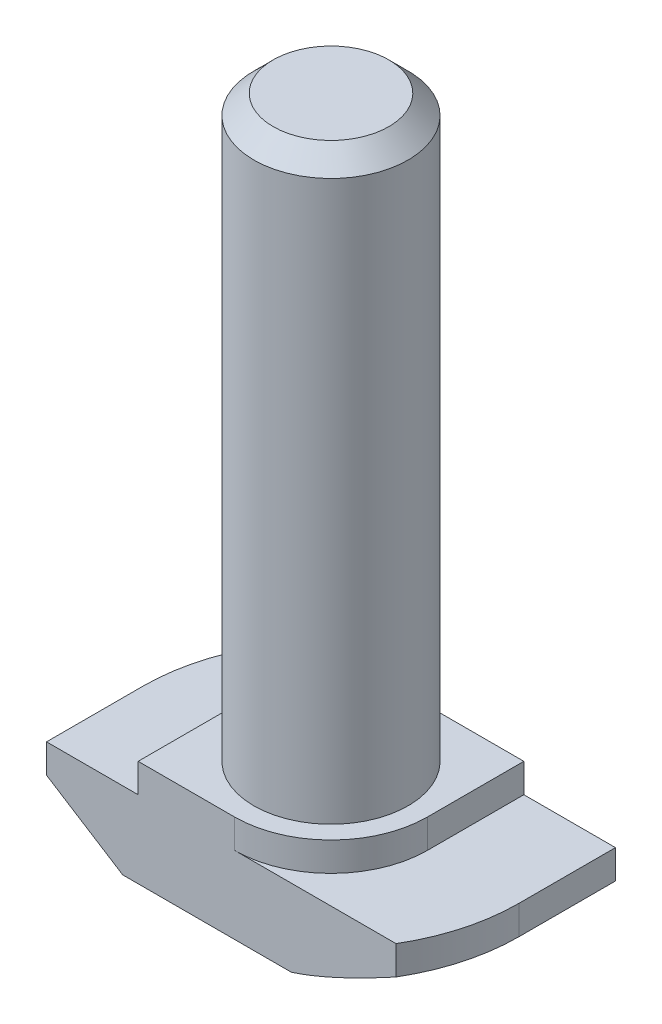
ISO-10303-21;
HEADER;
FILE_DESCRIPTION(('STEP AP214'),'2;1');
FILE_NAME('part.step','',(''),(''),'','','');
FILE_SCHEMA(('AUTOMOTIVE_DESIGN { 1 0 10303 214 1 1 1 1 }'));
ENDSEC;
DATA;
#1=APPLICATION_CONTEXT('core data for automotive mechanical design processes');
#2=APPLICATION_PROTOCOL_DEFINITION('international standard','automotive_design',2000,#1);
#3=PRODUCT_CONTEXT('',#1,'mechanical');
#4=PRODUCT('Part','Part','',(#3));
#5=PRODUCT_RELATED_PRODUCT_CATEGORY('part','',(#4));
#6=PRODUCT_DEFINITION_FORMATION('','',#4);
#7=PRODUCT_DEFINITION_CONTEXT('part definition',#1,'design');
#8=PRODUCT_DEFINITION('design','',#6,#7);
#9=PRODUCT_DEFINITION_SHAPE('','',#8);
#10=(LENGTH_UNIT() NAMED_UNIT(*) SI_UNIT(.MILLI.,.METRE.));
#11=(NAMED_UNIT(*) PLANE_ANGLE_UNIT() SI_UNIT($,.RADIAN.));
#12=(NAMED_UNIT(*) SI_UNIT($,.STERADIAN.) SOLID_ANGLE_UNIT());
#13=UNCERTAINTY_MEASURE_WITH_UNIT(LENGTH_MEASURE(1.E-05),#10,'distance_accuracy_value','');
#14=(GEOMETRIC_REPRESENTATION_CONTEXT(3) GLOBAL_UNCERTAINTY_ASSIGNED_CONTEXT((#13)) GLOBAL_UNIT_ASSIGNED_CONTEXT((#10,
#11,#12)) REPRESENTATION_CONTEXT('',''));
#15=CARTESIAN_POINT('',(0.,0.,0.));
#16=DIRECTION('',(0.,0.,1.));
#17=DIRECTION('',(1.,0.,0.));
#18=AXIS2_PLACEMENT_3D('',#15,#16,#17);
#19=CARTESIAN_POINT('',(-9.75,0.,5.));
#20=DIRECTION('',(1.,0.,0.));
#21=DIRECTION('',(0.,0.,-1.));
#22=AXIS2_PLACEMENT_3D('',#19,#20,#21);
#23=PLANE('',#22);
#24=DIRECTION('',(0.,0.,-1.));
#25=VECTOR('',#24,1.);
#26=CARTESIAN_POINT('',(-9.75,2.5,5.));
#27=LINE('',#26,#25);
#28=CARTESIAN_POINT('',(-9.75,2.5,5.));
#29=VERTEX_POINT('',#28);
#30=CARTESIAN_POINT('',(-9.75,2.5,0.));
#31=VERTEX_POINT('',#30);
#32=EDGE_CURVE('E372',#29,#31,#27,.T.);
#33=ORIENTED_EDGE('',*,*,#32,.F.);
#34=DIRECTION('',(0.,-1.,0.));
#35=VECTOR('',#34,1.);
#36=CARTESIAN_POINT('',(-9.75,0.,5.));
#37=LINE('',#36,#35);
#38=CARTESIAN_POINT('',(-9.75,4.,5.));
#39=VERTEX_POINT('',#38);
#40=EDGE_CURVE('E209',#39,#29,#37,.T.);
#41=ORIENTED_EDGE('',*,*,#40,.F.);
#42=DIRECTION('',(0.,0.,-1.));
#43=VECTOR('',#42,1.);
#44=CARTESIAN_POINT('',(-9.75,4.,5.));
#45=LINE('',#44,#43);
#46=CARTESIAN_POINT('',(-9.75,4.,0.));
#47=VERTEX_POINT('',#46);
#48=EDGE_CURVE('E224',#39,#47,#45,.T.);
#49=ORIENTED_EDGE('',*,*,#48,.T.);
#50=DIRECTION('',(0.,1.,0.));
#51=VECTOR('',#50,1.);
#52=CARTESIAN_POINT('',(-9.75,0.,0.));
#53=LINE('',#52,#51);
#54=EDGE_CURVE('E190',#31,#47,#53,.T.);
#55=ORIENTED_EDGE('',*,*,#54,.F.);
#56=EDGE_LOOP('',(#33,#41,#49,#55));
#57=FACE_BOUND('',#56,.T.);
#58=ADVANCED_FACE('F37',(#57),#23,.F.);
#59=CARTESIAN_POINT('',(9.75,0.,5.));
#60=DIRECTION('',(0.,1.,0.));
#61=DIRECTION('',(0.,0.,1.));
#62=AXIS2_PLACEMENT_3D('',#59,#60,#61);
#63=PLANE('',#62);
#64=DIRECTION('',(1.,0.,0.));
#65=VECTOR('',#64,1.);
#66=CARTESIAN_POINT('',(9.75,0.,5.));
#67=LINE('',#66,#65);
#68=CARTESIAN_POINT('',(-5.8,0.,5.));
#69=VERTEX_POINT('',#68);
#70=CARTESIAN_POINT('',(2.93938769133981,0.,5.));
#71=VERTEX_POINT('',#70);
#72=EDGE_CURVE('E212',#69,#71,#67,.T.);
#73=ORIENTED_EDGE('',*,*,#72,.F.);
#74=DIRECTION('',(0.,0.,-1.));
#75=VECTOR('',#74,1.);
#76=CARTESIAN_POINT('',(-5.8,0.,5.));
#77=LINE('',#76,#75);
#78=CARTESIAN_POINT('',(-5.8,0.,0.));
#79=VERTEX_POINT('',#78);
#80=EDGE_CURVE('E375',#69,#79,#77,.T.);
#81=ORIENTED_EDGE('',*,*,#80,.T.);
#82=CARTESIAN_POINT('',(0.,0.,0.));
#83=DIRECTION('',(0.,-1.,0.));
#84=DIRECTION('',(-1.,0.,0.));
#85=AXIS2_PLACEMENT_3D('',#82,#83,#84);
#86=CIRCLE('',#85,5.8);
#87=CARTESIAN_POINT('',(-2.93938769133982,0.,-5.));
#88=VERTEX_POINT('',#87);
#89=EDGE_CURVE('E385',#79,#88,#86,.T.);
#90=ORIENTED_EDGE('',*,*,#89,.T.);
#91=DIRECTION('',(1.,0.,0.));
#92=VECTOR('',#91,1.);
#93=CARTESIAN_POINT('',(9.75,0.,-5.));
#94=LINE('',#93,#92);
#95=CARTESIAN_POINT('',(5.8,0.,-5.));
#96=VERTEX_POINT('',#95);
#97=EDGE_CURVE('E208',#88,#96,#94,.T.);
#98=ORIENTED_EDGE('',*,*,#97,.T.);
#99=DIRECTION('',(0.,0.,1.));
#100=VECTOR('',#99,1.);
#101=CARTESIAN_POINT('',(5.8,0.,-9.75));
#102=LINE('',#101,#100);
#103=CARTESIAN_POINT('',(5.8,0.,0.));
#104=VERTEX_POINT('',#103);
#105=EDGE_CURVE('E53',#96,#104,#102,.T.);
#106=ORIENTED_EDGE('',*,*,#105,.T.);
#107=CARTESIAN_POINT('',(0.,0.,0.));
#108=DIRECTION('',(0.,-1.,0.));
#109=DIRECTION('',(1.,0.,0.));
#110=AXIS2_PLACEMENT_3D('',#107,#108,#109);
#111=CIRCLE('',#110,5.8);
#112=EDGE_CURVE('E153',#104,#71,#111,.T.);
#113=ORIENTED_EDGE('',*,*,#112,.T.);
#114=EDGE_LOOP('',(#73,#81,#90,#98,#106,#113));
#115=FACE_BOUND('',#114,.T.);
#116=ADVANCED_FACE('F270',(#115),#63,.F.);
#117=CARTESIAN_POINT('',(9.75,0.,5.));
#118=DIRECTION('',(-1.,0.,0.));
#119=DIRECTION('',(0.,0.,1.));
#120=AXIS2_PLACEMENT_3D('',#117,#118,#119);
#121=PLANE('',#120);
#122=DIRECTION('',(0.,0.,1.));
#123=VECTOR('',#122,1.);
#124=CARTESIAN_POINT('',(9.75,2.5,-9.75));
#125=LINE('',#124,#123);
#126=CARTESIAN_POINT('',(9.75,2.5,-5.));
#127=VERTEX_POINT('',#126);
#128=CARTESIAN_POINT('',(9.75,2.5,0.));
#129=VERTEX_POINT('',#128);
#130=EDGE_CURVE('E145',#127,#129,#125,.T.);
#131=ORIENTED_EDGE('',*,*,#130,.F.);
#132=DIRECTION('',(0.,1.,0.));
#133=VECTOR('',#132,1.);
#134=CARTESIAN_POINT('',(9.75,0.,-5.));
#135=LINE('',#134,#133);
#136=CARTESIAN_POINT('',(9.75,4.,-5.));
#137=VERTEX_POINT('',#136);
#138=EDGE_CURVE('E227',#127,#137,#135,.T.);
#139=ORIENTED_EDGE('',*,*,#138,.T.);
#140=DIRECTION('',(0.,0.,-1.));
#141=VECTOR('',#140,1.);
#142=CARTESIAN_POINT('',(9.75,4.,5.));
#143=LINE('',#142,#141);
#144=CARTESIAN_POINT('',(9.75,4.,0.));
#145=VERTEX_POINT('',#144);
#146=EDGE_CURVE('E173',#145,#137,#143,.T.);
#147=ORIENTED_EDGE('',*,*,#146,.F.);
#148=DIRECTION('',(0.,1.,0.));
#149=VECTOR('',#148,1.);
#150=CARTESIAN_POINT('',(9.75,0.,0.));
#151=LINE('',#150,#149);
#152=EDGE_CURVE('E166',#129,#145,#151,.T.);
#153=ORIENTED_EDGE('',*,*,#152,.F.);
#154=EDGE_LOOP('',(#131,#139,#147,#153));
#155=FACE_BOUND('',#154,.T.);
#156=ADVANCED_FACE('F171',(#155),#121,.F.);
#157=CARTESIAN_POINT('',(0.,0.,5.));
#158=DIRECTION('',(0.,0.,-1.));
#159=DIRECTION('',(-1.,0.,0.));
#160=AXIS2_PLACEMENT_3D('',#157,#158,#159);
#161=PLANE('',#160);
#162=DIRECTION('',(-0.844980197489509,0.534797593347791,0.));
#163=VECTOR('',#162,1.);
#164=CARTESIAN_POINT('',(-9.75,2.5,5.));
#165=LINE('',#164,#163);
#166=EDGE_CURVE('E373',#69,#29,#165,.T.);
#167=ORIENTED_EDGE('',*,*,#166,.F.);
#168=ORIENTED_EDGE('',*,*,#72,.T.);
#169=CARTESIAN_POINT('',(8.3710345213916,2.50038035044416,5.));
#170=CARTESIAN_POINT('',(8.14485503763147,2.37751255056509,5.));
#171=CARTESIAN_POINT('',(7.91814414436424,2.25560825185528,5.));
#172=CARTESIAN_POINT('',(7.46336802856226,2.01427419874183,5.));
#173=CARTESIAN_POINT('',(7.23530261352057,1.89484480745523,5.));
#174=CARTESIAN_POINT('',(6.77658273225198,1.65852444966252,5.));
#175=CARTESIAN_POINT('',(6.54592128446781,1.54164699581211,5.));
#176=CARTESIAN_POINT('',(6.08267383878011,1.31178770374963,5.));
#177=CARTESIAN_POINT('',(5.85008793878494,1.19880566884712,5.));
#178=CARTESIAN_POINT('',(5.38850045895099,0.980602867779513,5.));
#179=CARTESIAN_POINT('',(5.1595578408824,0.875257869563463,5.));
#180=CARTESIAN_POINT('',(4.69895239023341,0.670592548807996,5.));
#181=CARTESIAN_POINT('',(4.46728928872485,0.571272827972461,5.));
#182=CARTESIAN_POINT('',(4.00108707979834,0.38059166900738,5.));
#183=CARTESIAN_POINT('',(3.76655273287754,0.289218677543095,5.));
#184=CARTESIAN_POINT('',(3.29379614776259,0.116644148005836,5.));
#185=CARTESIAN_POINT('',(3.05557490729072,0.0354399103972046,5.));
#186=CARTESIAN_POINT('',(2.58854667138869,-0.109582099168053,5.));
#187=CARTESIAN_POINT('',(2.35996631966938,-0.174122082532671,5.));
#188=CARTESIAN_POINT('',(1.89919260818542,-0.288382603381046,5.));
#189=CARTESIAN_POINT('',(1.66700173473846,-0.33811290172539,5.));
#190=CARTESIAN_POINT('',(1.31509928874305,-0.399489564391158,5.));
#191=CARTESIAN_POINT('',(1.19653459621012,-0.417808799856712,5.));
#192=CARTESIAN_POINT('',(0.958746309721246,-0.449516897628666,5.));
#193=CARTESIAN_POINT('',(0.839522754036867,-0.462906043317658,5.));
#194=CARTESIAN_POINT('',(0.600273143638718,-0.484487035929079,5.));
#195=CARTESIAN_POINT('',(0.480245784105953,-0.492664504258673,5.));
#196=CARTESIAN_POINT('',(0.239914647066935,-0.50360257514633,5.));
#197=CARTESIAN_POINT('',(0.119610806307569,-0.506361781459069,5.));
#198=CARTESIAN_POINT('',(-0.000700000000000271,-0.506329082911393,5.));
#199=B_SPLINE_CURVE_WITH_KNOTS('',3,(#169,#170,#171,#172,#173,#174,#175,#176,#177,#178,#179,
#180,#181,#182,#183,#184,#185,#186,#187,#188,#189,#190,#191,#192,#193,#194,#195,#196,#197,#198),
.UNSPECIFIED.,.F.,.F.,(4,2,2,2,2,2,2,2,2,2,2,2,2,2,4),(0.,0.772201750738158,1.54451600760777,
2.32023520866627,3.09591518399236,3.85189775311528,4.60795569327251,5.36289539506572,
6.1176342534965,6.82981297940338,7.54152127390794,7.90134934767844,8.26115673522602,
8.62195255315834,8.98284133326183),.UNSPECIFIED.);
#200=CARTESIAN_POINT('',(8.3703345213916,2.5,5.));
#201=VERTEX_POINT('',#200);
#202=EDGE_CURVE('E318',#201,#71,#199,.T.);
#203=ORIENTED_EDGE('',*,*,#202,.F.);
#204=DIRECTION('',(0.,1.,0.));
#205=VECTOR('',#204,1.);
#206=CARTESIAN_POINT('',(8.3703345213916,0.,5.));
#207=LINE('',#206,#205);
#208=CARTESIAN_POINT('',(8.3703345213916,4.,5.));
#209=VERTEX_POINT('',#208);
#210=EDGE_CURVE('E168',#201,#209,#207,.T.);
#211=ORIENTED_EDGE('',*,*,#210,.T.);
#212=DIRECTION('',(-1.,0.,0.));
#213=VECTOR('',#212,1.);
#214=CARTESIAN_POINT('',(9.75,4.,5.));
#215=LINE('',#214,#213);
#216=CARTESIAN_POINT('',(0.,4.,5.));
#217=VERTEX_POINT('',#216);
#218=EDGE_CURVE('E216',#209,#217,#215,.T.);
#219=ORIENTED_EDGE('',*,*,#218,.T.);
#220=DIRECTION('',(0.,1.,0.));
#221=VECTOR('',#220,1.);
#222=CARTESIAN_POINT('',(0.,-3.07106781186548,5.));
#223=LINE('',#222,#221);
#224=CARTESIAN_POINT('',(0.,5.5,5.));
#225=VERTEX_POINT('',#224);
#226=EDGE_CURVE('E194',#217,#225,#223,.T.);
#227=ORIENTED_EDGE('',*,*,#226,.T.);
#228=DIRECTION('',(-1.,0.,0.));
#229=VECTOR('',#228,1.);
#230=CARTESIAN_POINT('',(-5.,5.5,5.));
#231=LINE('',#230,#229);
#232=CARTESIAN_POINT('',(-5.,5.5,5.));
#233=VERTEX_POINT('',#232);
#234=EDGE_CURVE('E218',#225,#233,#231,.T.);
#235=ORIENTED_EDGE('',*,*,#234,.T.);
#236=DIRECTION('',(0.,-1.,0.));
#237=VECTOR('',#236,1.);
#238=CARTESIAN_POINT('',(-5.,4.,5.));
#239=LINE('',#238,#237);
#240=CARTESIAN_POINT('',(-5.,4.,5.));
#241=VERTEX_POINT('',#240);
#242=EDGE_CURVE('E220',#233,#241,#239,.T.);
#243=ORIENTED_EDGE('',*,*,#242,.T.);
#244=DIRECTION('',(-1.,0.,0.));
#245=VECTOR('',#244,1.);
#246=CARTESIAN_POINT('',(-9.75,4.,5.));
#247=LINE('',#246,#245);
#248=EDGE_CURVE('E222',#241,#39,#247,.T.);
#249=ORIENTED_EDGE('',*,*,#248,.T.);
#250=ORIENTED_EDGE('',*,*,#40,.T.);
#251=EDGE_LOOP('',(#167,#168,#203,#211,#219,#227,#235,#243,#249,#250));
#252=FACE_BOUND('',#251,.T.);
#253=ADVANCED_FACE('F281',(#252),#161,.F.);
#254=CARTESIAN_POINT('',(0.,0.,-5.));
#255=DIRECTION('',(0.,0.,-1.));
#256=DIRECTION('',(-1.,0.,0.));
#257=AXIS2_PLACEMENT_3D('',#254,#255,#256);
#258=PLANE('',#257);
#259=ORIENTED_EDGE('',*,*,#97,.F.);
#260=CARTESIAN_POINT('',(0.00070000000000138,-0.506329082911397,-5.));
#261=CARTESIAN_POINT('',(-0.11492355286762,-0.506358201187866,-5.));
#262=CARTESIAN_POINT('',(-0.230541342283267,-0.503811651701555,-5.));
#263=CARTESIAN_POINT('',(-0.461532910337905,-0.493707507103407,-5.));
#264=CARTESIAN_POINT('',(-0.576906737550149,-0.48615102719651,-5.));
#265=CARTESIAN_POINT('',(-0.806948113963408,-0.466191618236643,-5.));
#266=CARTESIAN_POINT('',(-0.921616700128454,-0.453800577810883,-5.));
#267=CARTESIAN_POINT('',(-1.15036260798101,-0.424427750820964,-5.));
#268=CARTESIAN_POINT('',(-1.26443990025042,-0.407445738038838,-5.));
#269=CARTESIAN_POINT('',(-1.60314096911344,-0.350479262852961,-5.));
#270=CARTESIAN_POINT('',(-1.82673025128966,-0.304244681434307,-5.));
#271=CARTESIAN_POINT('',(-2.27058382288403,-0.197749704270996,-5.));
#272=CARTESIAN_POINT('',(-2.49084621805169,-0.13748161665558,-5.));
#273=CARTESIAN_POINT('',(-2.95448552535975,0.00231900980771354,-5.));
#274=CARTESIAN_POINT('',(-3.19742086780124,0.0833022458753652,-5.));
#275=CARTESIAN_POINT('',(-3.67941522891594,0.256156738222036,-5.));
#276=CARTESIAN_POINT('',(-3.91847303773159,0.348031321223873,-5.));
#277=CARTESIAN_POINT('',(-4.39361886594961,0.540256398970149,-5.));
#278=CARTESIAN_POINT('',(-4.62970092868475,0.640621503905241,-5.));
#279=CARTESIAN_POINT('',(-5.09899519125866,0.847741673465407,-5.));
#280=CARTESIAN_POINT('',(-5.33220771380245,0.95449601149878,-5.));
#281=CARTESIAN_POINT('',(-5.80260552399803,1.17594489337857,-5.));
#282=CARTESIAN_POINT('',(-6.0397260114898,1.29077650765228,-5.));
#283=CARTESIAN_POINT('',(-6.51194869465368,1.52453629386533,-5.));
#284=CARTESIAN_POINT('',(-6.74705077660686,1.6434646947539,-5.));
#285=CARTESIAN_POINT('',(-7.21442387447975,1.88395034865552,-5.));
#286=CARTESIAN_POINT('',(-7.44670315486301,2.00549158860828,-5.));
#287=CARTESIAN_POINT('',(-7.90984974140112,2.25114994882745,-5.));
#288=CARTESIAN_POINT('',(-8.14071726576929,2.37526665727356,-5.));
#289=CARTESIAN_POINT('',(-8.3710345213916,2.50038035044416,-5.));
#290=B_SPLINE_CURVE_WITH_KNOTS('',3,(#260,#261,#262,#263,#264,#265,#266,#267,#268,#269,#270,
#271,#272,#273,#274,#275,#276,#277,#278,#279,#280,#281,#282,#283,#284,#285,#286,#287,#288,#289),
.UNSPECIFIED.,.F.,.F.,(4,2,2,2,2,2,2,2,2,2,2,2,2,2,4),(0.,0.346832601073218,0.693588023504655,
1.03949606304986,1.38542115015583,2.06977108877902,2.75449701140492,3.52238142993095,
4.29050100328089,5.05997031676438,5.82935229087948,6.61968962937037,7.41007120780528,
8.19652251048066,8.98284901326047),.UNSPECIFIED.);
#291=CARTESIAN_POINT('',(-8.3703345213916,2.5,-5.));
#292=VERTEX_POINT('',#291);
#293=EDGE_CURVE('E312',#88,#292,#290,.T.);
#294=ORIENTED_EDGE('',*,*,#293,.T.);
#295=DIRECTION('',(0.,1.,0.));
#296=VECTOR('',#295,1.);
#297=CARTESIAN_POINT('',(-8.3703345213916,0.,-5.));
#298=LINE('',#297,#296);
#299=CARTESIAN_POINT('',(-8.3703345213916,4.,-5.));
#300=VERTEX_POINT('',#299);
#301=EDGE_CURVE('E177',#292,#300,#298,.T.);
#302=ORIENTED_EDGE('',*,*,#301,.T.);
#303=DIRECTION('',(-1.,0.,0.));
#304=VECTOR('',#303,1.);
#305=CARTESIAN_POINT('',(-9.75,4.,-5.));
#306=LINE('',#305,#304);
#307=CARTESIAN_POINT('',(0.,4.,-5.));
#308=VERTEX_POINT('',#307);
#309=EDGE_CURVE('E213',#308,#300,#306,.T.);
#310=ORIENTED_EDGE('',*,*,#309,.F.);
#311=DIRECTION('',(0.,1.,0.));
#312=VECTOR('',#311,1.);
#313=CARTESIAN_POINT('',(0.,-3.07106781186548,-5.));
#314=LINE('',#313,#312);
#315=CARTESIAN_POINT('',(0.,5.5,-5.));
#316=VERTEX_POINT('',#315);
#317=EDGE_CURVE('E204',#308,#316,#314,.T.);
#318=ORIENTED_EDGE('',*,*,#317,.T.);
#319=DIRECTION('',(-1.,0.,0.));
#320=VECTOR('',#319,1.);
#321=CARTESIAN_POINT('',(-5.,5.5,-5.));
#322=LINE('',#321,#320);
#323=CARTESIAN_POINT('',(5.,5.5,-5.));
#324=VERTEX_POINT('',#323);
#325=EDGE_CURVE('E235',#324,#316,#322,.T.);
#326=ORIENTED_EDGE('',*,*,#325,.F.);
#327=DIRECTION('',(0.,1.,0.));
#328=VECTOR('',#327,1.);
#329=CARTESIAN_POINT('',(5.,4.,-5.));
#330=LINE('',#329,#328);
#331=CARTESIAN_POINT('',(5.,4.,-5.));
#332=VERTEX_POINT('',#331);
#333=EDGE_CURVE('E232',#332,#324,#330,.T.);
#334=ORIENTED_EDGE('',*,*,#333,.F.);
#335=DIRECTION('',(-1.,0.,0.));
#336=VECTOR('',#335,1.);
#337=CARTESIAN_POINT('',(9.75,4.,-5.));
#338=LINE('',#337,#336);
#339=EDGE_CURVE('E229',#137,#332,#338,.T.);
#340=ORIENTED_EDGE('',*,*,#339,.F.);
#341=ORIENTED_EDGE('',*,*,#138,.F.);
#342=DIRECTION('',(-0.84498019748951,-0.534797593347791,0.));
#343=VECTOR('',#342,1.);
#344=CARTESIAN_POINT('',(1.65884910193342,-2.6209815810548,-5.));
#345=LINE('',#344,#343);
#346=EDGE_CURVE('E149',#127,#96,#345,.T.);
#347=ORIENTED_EDGE('',*,*,#346,.T.);
#348=EDGE_LOOP('',(#259,#294,#302,#310,#318,#326,#334,#340,#341,#347));
#349=FACE_BOUND('',#348,.T.);
#350=ADVANCED_FACE('F303',(#349),#258,.T.);
#351=CARTESIAN_POINT('',(0.,0.,0.));
#352=DIRECTION('',(0.,1.,0.));
#353=DIRECTION('',(0.,0.,1.));
#354=AXIS2_PLACEMENT_3D('',#351,#352,#353);
#355=CYLINDRICAL_SURFACE('',#354,9.75);
#356=CARTESIAN_POINT('',(0.,2.5,0.));
#357=DIRECTION('',(0.,-1.,0.));
#358=DIRECTION('',(-1.,0.,0.));
#359=AXIS2_PLACEMENT_3D('',#356,#357,#358);
#360=CIRCLE('',#359,9.75);
#361=EDGE_CURVE('E61',#31,#292,#360,.T.);
#362=ORIENTED_EDGE('',*,*,#361,.F.);
#363=ORIENTED_EDGE('',*,*,#54,.T.);
#364=CARTESIAN_POINT('',(0.,4.,0.));
#365=DIRECTION('',(0.,-1.,0.));
#366=DIRECTION('',(0.,0.,-1.));
#367=AXIS2_PLACEMENT_3D('',#364,#365,#366);
#368=CIRCLE('',#367,9.75);
#369=EDGE_CURVE('E174',#47,#300,#368,.T.);
#370=ORIENTED_EDGE('',*,*,#369,.T.);
#371=ORIENTED_EDGE('',*,*,#301,.F.);
#372=EDGE_LOOP('',(#362,#363,#370,#371));
#373=FACE_BOUND('',#372,.T.);
#374=ADVANCED_FACE('F307',(#373),#355,.T.);
#375=CARTESIAN_POINT('',(0.,0.,0.));
#376=DIRECTION('',(0.,1.,0.));
#377=DIRECTION('',(0.,0.,1.));
#378=AXIS2_PLACEMENT_3D('',#375,#376,#377);
#379=CYLINDRICAL_SURFACE('',#378,9.75);
#380=CARTESIAN_POINT('',(0.,2.5,0.));
#381=DIRECTION('',(0.,-1.,0.));
#382=DIRECTION('',(1.,0.,0.));
#383=AXIS2_PLACEMENT_3D('',#380,#381,#382);
#384=CIRCLE('',#383,9.75);
#385=EDGE_CURVE('E158',#129,#201,#384,.T.);
#386=ORIENTED_EDGE('',*,*,#385,.F.);
#387=ORIENTED_EDGE('',*,*,#152,.T.);
#388=CARTESIAN_POINT('',(0.,4.,0.));
#389=DIRECTION('',(0.,-1.,0.));
#390=DIRECTION('',(0.,0.,-1.));
#391=AXIS2_PLACEMENT_3D('',#388,#389,#390);
#392=CIRCLE('',#391,9.75);
#393=EDGE_CURVE('E179',#145,#209,#392,.T.);
#394=ORIENTED_EDGE('',*,*,#393,.T.);
#395=ORIENTED_EDGE('',*,*,#210,.F.);
#396=EDGE_LOOP('',(#386,#387,#394,#395));
#397=FACE_BOUND('',#396,.T.);
#398=ADVANCED_FACE('F164',(#397),#379,.T.);
#399=CARTESIAN_POINT('',(-5.,5.5,5.));
#400=DIRECTION('',(0.,-1.,0.));
#401=DIRECTION('',(0.,0.,-1.));
#402=AXIS2_PLACEMENT_3D('',#399,#400,#401);
#403=PLANE('',#402);
#404=CARTESIAN_POINT('',(0.,5.5,0.));
#405=DIRECTION('',(0.,1.,0.));
#406=DIRECTION('',(0.,0.,1.));
#407=AXIS2_PLACEMENT_3D('',#404,#405,#406);
#408=CIRCLE('',#407,4.);
#409=CARTESIAN_POINT('',(0.,5.5,4.));
#410=VERTEX_POINT('',#409);
#411=EDGE_CURVE('E184',#410,#410,#408,.T.);
#412=ORIENTED_EDGE('',*,*,#411,.F.);
#413=EDGE_LOOP('',(#412));
#414=FACE_BOUND('',#413,.T.);
#415=ORIENTED_EDGE('',*,*,#234,.F.);
#416=CARTESIAN_POINT('',(0.,5.5,0.));
#417=DIRECTION('',(0.,-1.,0.));
#418=DIRECTION('',(0.,0.,-1.));
#419=AXIS2_PLACEMENT_3D('',#416,#417,#418);
#420=CIRCLE('',#419,5.);
#421=CARTESIAN_POINT('',(5.,5.5,0.));
#422=VERTEX_POINT('',#421);
#423=EDGE_CURVE('E187',#422,#225,#420,.T.);
#424=ORIENTED_EDGE('',*,*,#423,.F.);
#425=DIRECTION('',(0.,0.,-1.));
#426=VECTOR('',#425,1.);
#427=CARTESIAN_POINT('',(5.,5.5,5.));
#428=LINE('',#427,#426);
#429=EDGE_CURVE('E248',#422,#324,#428,.T.);
#430=ORIENTED_EDGE('',*,*,#429,.T.);
#431=ORIENTED_EDGE('',*,*,#325,.T.);
#432=CARTESIAN_POINT('',(0.,5.5,0.));
#433=DIRECTION('',(0.,-1.,0.));
#434=DIRECTION('',(0.,0.,-1.));
#435=AXIS2_PLACEMENT_3D('',#432,#433,#434);
#436=CIRCLE('',#435,5.);
#437=CARTESIAN_POINT('',(-5.,5.5,0.));
#438=VERTEX_POINT('',#437);
#439=EDGE_CURVE('E198',#438,#316,#436,.T.);
#440=ORIENTED_EDGE('',*,*,#439,.F.);
#441=DIRECTION('',(0.,0.,-1.));
#442=VECTOR('',#441,1.);
#443=CARTESIAN_POINT('',(-5.,5.5,5.));
#444=LINE('',#443,#442);
#445=EDGE_CURVE('E245',#233,#438,#444,.T.);
#446=ORIENTED_EDGE('',*,*,#445,.F.);
#447=EDGE_LOOP('',(#415,#424,#430,#431,#440,#446));
#448=FACE_BOUND('',#447,.T.);
#449=ADVANCED_FACE('F286',(#414,#448),#403,.F.);
#450=CARTESIAN_POINT('',(9.75,4.,5.));
#451=DIRECTION('',(0.,-1.,0.));
#452=DIRECTION('',(0.,0.,-1.));
#453=AXIS2_PLACEMENT_3D('',#450,#451,#452);
#454=PLANE('',#453);
#455=ORIENTED_EDGE('',*,*,#218,.F.);
#456=ORIENTED_EDGE('',*,*,#393,.F.);
#457=ORIENTED_EDGE('',*,*,#146,.T.);
#458=ORIENTED_EDGE('',*,*,#339,.T.);
#459=DIRECTION('',(0.,0.,-1.));
#460=VECTOR('',#459,1.);
#461=CARTESIAN_POINT('',(5.,4.,5.));
#462=LINE('',#461,#460);
#463=CARTESIAN_POINT('',(5.,4.,0.));
#464=VERTEX_POINT('',#463);
#465=EDGE_CURVE('E250',#464,#332,#462,.T.);
#466=ORIENTED_EDGE('',*,*,#465,.F.);
#467=CARTESIAN_POINT('',(0.,4.,0.));
#468=DIRECTION('',(0.,-1.,0.));
#469=DIRECTION('',(0.,0.,-1.));
#470=AXIS2_PLACEMENT_3D('',#467,#468,#469);
#471=CIRCLE('',#470,5.);
#472=EDGE_CURVE('E191',#464,#217,#471,.T.);
#473=ORIENTED_EDGE('',*,*,#472,.T.);
#474=EDGE_LOOP('',(#455,#456,#457,#458,#466,#473));
#475=FACE_BOUND('',#474,.T.);
#476=ADVANCED_FACE('F282',(#475),#454,.F.);
#477=CARTESIAN_POINT('',(5.,4.,5.));
#478=DIRECTION('',(-1.,0.,0.));
#479=DIRECTION('',(0.,0.,1.));
#480=AXIS2_PLACEMENT_3D('',#477,#478,#479);
#481=PLANE('',#480);
#482=ORIENTED_EDGE('',*,*,#429,.F.);
#483=DIRECTION('',(0.,1.,0.));
#484=VECTOR('',#483,1.);
#485=CARTESIAN_POINT('',(5.,-3.07106781186548,0.));
#486=LINE('',#485,#484);
#487=EDGE_CURVE('E189',#464,#422,#486,.T.);
#488=ORIENTED_EDGE('',*,*,#487,.F.);
#489=ORIENTED_EDGE('',*,*,#465,.T.);
#490=ORIENTED_EDGE('',*,*,#333,.T.);
#491=EDGE_LOOP('',(#482,#488,#489,#490));
#492=FACE_BOUND('',#491,.T.);
#493=ADVANCED_FACE('F285',(#492),#481,.F.);
#494=CARTESIAN_POINT('',(-5.,4.,5.));
#495=DIRECTION('',(1.,0.,0.));
#496=DIRECTION('',(0.,0.,-1.));
#497=AXIS2_PLACEMENT_3D('',#494,#495,#496);
#498=PLANE('',#497);
#499=ORIENTED_EDGE('',*,*,#445,.T.);
#500=DIRECTION('',(0.,1.,0.));
#501=VECTOR('',#500,1.);
#502=CARTESIAN_POINT('',(-5.,-3.07106781186548,0.));
#503=LINE('',#502,#501);
#504=CARTESIAN_POINT('',(-5.,4.,0.));
#505=VERTEX_POINT('',#504);
#506=EDGE_CURVE('E200',#505,#438,#503,.T.);
#507=ORIENTED_EDGE('',*,*,#506,.F.);
#508=DIRECTION('',(0.,0.,-1.));
#509=VECTOR('',#508,1.);
#510=CARTESIAN_POINT('',(-5.,4.,5.));
#511=LINE('',#510,#509);
#512=EDGE_CURVE('E242',#241,#505,#511,.T.);
#513=ORIENTED_EDGE('',*,*,#512,.F.);
#514=ORIENTED_EDGE('',*,*,#242,.F.);
#515=EDGE_LOOP('',(#499,#507,#513,#514));
#516=FACE_BOUND('',#515,.T.);
#517=ADVANCED_FACE('F290',(#516),#498,.F.);
#518=CARTESIAN_POINT('',(-9.75,4.,5.));
#519=DIRECTION('',(0.,-1.,0.));
#520=DIRECTION('',(0.,0.,-1.));
#521=AXIS2_PLACEMENT_3D('',#518,#519,#520);
#522=PLANE('',#521);
#523=ORIENTED_EDGE('',*,*,#309,.T.);
#524=ORIENTED_EDGE('',*,*,#369,.F.);
#525=ORIENTED_EDGE('',*,*,#48,.F.);
#526=ORIENTED_EDGE('',*,*,#248,.F.);
#527=ORIENTED_EDGE('',*,*,#512,.T.);
#528=CARTESIAN_POINT('',(0.,4.,0.));
#529=DIRECTION('',(0.,-1.,0.));
#530=DIRECTION('',(0.,0.,-1.));
#531=AXIS2_PLACEMENT_3D('',#528,#529,#530);
#532=CIRCLE('',#531,5.);
#533=EDGE_CURVE('E201',#505,#308,#532,.T.);
#534=ORIENTED_EDGE('',*,*,#533,.T.);
#535=EDGE_LOOP('',(#523,#524,#525,#526,#527,#534));
#536=FACE_BOUND('',#535,.T.);
#537=ADVANCED_FACE('F297',(#536),#522,.F.);
#538=CARTESIAN_POINT('',(0.,-3.07106781186548,0.));
#539=DIRECTION('',(0.,1.,0.));
#540=DIRECTION('',(0.,0.,1.));
#541=AXIS2_PLACEMENT_3D('',#538,#539,#540);
#542=CYLINDRICAL_SURFACE('',#541,5.);
#543=ORIENTED_EDGE('',*,*,#506,.T.);
#544=ORIENTED_EDGE('',*,*,#439,.T.);
#545=ORIENTED_EDGE('',*,*,#317,.F.);
#546=ORIENTED_EDGE('',*,*,#533,.F.);
#547=EDGE_LOOP('',(#543,#544,#545,#546));
#548=FACE_BOUND('',#547,.T.);
#549=ADVANCED_FACE('F301',(#548),#542,.T.);
#550=CARTESIAN_POINT('',(0.,-3.07106781186548,0.));
#551=DIRECTION('',(0.,1.,0.));
#552=DIRECTION('',(0.,0.,1.));
#553=AXIS2_PLACEMENT_3D('',#550,#551,#552);
#554=CYLINDRICAL_SURFACE('',#553,5.);
#555=ORIENTED_EDGE('',*,*,#487,.T.);
#556=ORIENTED_EDGE('',*,*,#423,.T.);
#557=ORIENTED_EDGE('',*,*,#226,.F.);
#558=ORIENTED_EDGE('',*,*,#472,.F.);
#559=EDGE_LOOP('',(#555,#556,#557,#558));
#560=FACE_BOUND('',#559,.T.);
#561=ADVANCED_FACE('F339',(#560),#554,.T.);
#562=CARTESIAN_POINT('',(0.,35.5,0.));
#563=DIRECTION('',(0.,-1.,0.));
#564=DIRECTION('',(0.,0.,-1.));
#565=AXIS2_PLACEMENT_3D('',#562,#563,#564);
#566=CYLINDRICAL_SURFACE('',#565,4.);
#567=CARTESIAN_POINT('',(0.,34.5,0.));
#568=DIRECTION('',(0.,1.,0.));
#569=DIRECTION('',(0.,0.,1.));
#570=AXIS2_PLACEMENT_3D('',#567,#568,#569);
#571=CIRCLE('',#570,4.);
#572=CARTESIAN_POINT('',(0.,34.5,4.));
#573=VERTEX_POINT('',#572);
#574=EDGE_CURVE('E11',#573,#573,#571,.F.);
#575=ORIENTED_EDGE('',*,*,#574,.T.);
#576=EDGE_LOOP('',(#575));
#577=FACE_BOUND('',#576,.T.);
#578=ORIENTED_EDGE('',*,*,#411,.T.);
#579=EDGE_LOOP('',(#578));
#580=FACE_BOUND('',#579,.T.);
#581=ADVANCED_FACE('F336',(#577,#580),#566,.T.);
#582=CARTESIAN_POINT('',(0.,35.5,0.));
#583=DIRECTION('',(0.,1.,0.));
#584=DIRECTION('',(0.,0.,1.));
#585=AXIS2_PLACEMENT_3D('',#582,#583,#584);
#586=PLANE('',#585);
#587=CARTESIAN_POINT('',(0.,35.5,0.));
#588=DIRECTION('',(0.,1.,0.));
#589=DIRECTION('',(0.,0.,1.));
#590=AXIS2_PLACEMENT_3D('',#587,#588,#589);
#591=CIRCLE('',#590,3.);
#592=CARTESIAN_POINT('',(0.,35.5,3.));
#593=VERTEX_POINT('',#592);
#594=EDGE_CURVE('E46',#593,#593,#591,.T.);
#595=ORIENTED_EDGE('',*,*,#594,.T.);
#596=EDGE_LOOP('',(#595));
#597=FACE_BOUND('',#596,.T.);
#598=ADVANCED_FACE('F255',(#597),#586,.T.);
#599=CARTESIAN_POINT('',(9.75,2.5,-9.75));
#600=DIRECTION('',(0.534797593347791,-0.84498019748951,0.));
#601=DIRECTION('',(0.84498019748951,0.534797593347791,0.));
#602=AXIS2_PLACEMENT_3D('',#599,#600,#601);
#603=PLANE('',#602);
#604=ORIENTED_EDGE('',*,*,#130,.T.);
#605=DIRECTION('',(0.844980197489509,0.534797593347791,0.));
#606=VECTOR('',#605,1.);
#607=CARTESIAN_POINT('',(9.75,2.5,0.));
#608=LINE('',#607,#606);
#609=EDGE_CURVE('E148',#104,#129,#608,.T.);
#610=ORIENTED_EDGE('',*,*,#609,.F.);
#611=ORIENTED_EDGE('',*,*,#105,.F.);
#612=ORIENTED_EDGE('',*,*,#346,.F.);
#613=EDGE_LOOP('',(#604,#610,#611,#612));
#614=FACE_BOUND('',#613,.T.);
#615=ADVANCED_FACE('F147',(#614),#603,.T.);
#616=CARTESIAN_POINT('',(0.,0.,0.));
#617=DIRECTION('',(0.,1.,0.));
#618=DIRECTION('',(0.,0.,1.));
#619=AXIS2_PLACEMENT_3D('',#616,#617,#618);
#620=CONICAL_SURFACE('',#619,5.8,1.00652813793696);
#621=ORIENTED_EDGE('',*,*,#202,.T.);
#622=ORIENTED_EDGE('',*,*,#112,.F.);
#623=ORIENTED_EDGE('',*,*,#609,.T.);
#624=ORIENTED_EDGE('',*,*,#385,.T.);
#625=EDGE_LOOP('',(#621,#622,#623,#624));
#626=FACE_BOUND('',#625,.T.);
#627=ADVANCED_FACE('F157',(#626),#620,.T.);
#628=CARTESIAN_POINT('',(-9.75,2.5,5.));
#629=DIRECTION('',(-0.534797593347791,-0.844980197489509,0.));
#630=DIRECTION('',(0.84498019748951,-0.534797593347791,0.));
#631=AXIS2_PLACEMENT_3D('',#628,#629,#630);
#632=PLANE('',#631);
#633=ORIENTED_EDGE('',*,*,#32,.T.);
#634=DIRECTION('',(-0.844980197489509,0.534797593347791,0.));
#635=VECTOR('',#634,1.);
#636=CARTESIAN_POINT('',(-9.75,2.5,0.));
#637=LINE('',#636,#635);
#638=EDGE_CURVE('E382',#79,#31,#637,.T.);
#639=ORIENTED_EDGE('',*,*,#638,.F.);
#640=ORIENTED_EDGE('',*,*,#80,.F.);
#641=ORIENTED_EDGE('',*,*,#166,.T.);
#642=EDGE_LOOP('',(#633,#639,#640,#641));
#643=FACE_BOUND('',#642,.T.);
#644=ADVANCED_FACE('F260',(#643),#632,.T.);
#645=CARTESIAN_POINT('',(0.,0.,0.));
#646=DIRECTION('',(0.,1.,0.));
#647=DIRECTION('',(0.,0.,1.));
#648=AXIS2_PLACEMENT_3D('',#645,#646,#647);
#649=CONICAL_SURFACE('',#648,5.8,1.00652813793696);
#650=ORIENTED_EDGE('',*,*,#89,.F.);
#651=ORIENTED_EDGE('',*,*,#638,.T.);
#652=ORIENTED_EDGE('',*,*,#361,.T.);
#653=ORIENTED_EDGE('',*,*,#293,.F.);
#654=EDGE_LOOP('',(#650,#651,#652,#653));
#655=FACE_BOUND('',#654,.T.);
#656=ADVANCED_FACE('F258',(#655),#649,.T.);
#657=CARTESIAN_POINT('',(0.,35.5,0.));
#658=DIRECTION('',(0.,-1.,0.));
#659=DIRECTION('',(0.,0.,-1.));
#660=AXIS2_PLACEMENT_3D('',#657,#658,#659);
#661=CONICAL_SURFACE('',#660,3.,0.785398163397443);
#662=ORIENTED_EDGE('',*,*,#574,.F.);
#663=EDGE_LOOP('',(#662));
#664=FACE_BOUND('',#663,.T.);
#665=ORIENTED_EDGE('',*,*,#594,.F.);
#666=EDGE_LOOP('',(#665));
#667=FACE_BOUND('',#666,.T.);
#668=ADVANCED_FACE('F40',(#664,#667),#661,.T.);
#669=CLOSED_SHELL('',(#58,#116,#156,#253,#350,#374,#398,#449,#476,#493,#517,#537,#549,#561,#581,
#598,#615,#627,#644,#656,#668));
#670=MANIFOLD_SOLID_BREP('B2',#669);
#671=ADVANCED_BREP_SHAPE_REPRESENTATION('',(#18,#670),#14);
#672=SHAPE_DEFINITION_REPRESENTATION(#9,#671);
ENDSEC;
END-ISO-10303-21;
